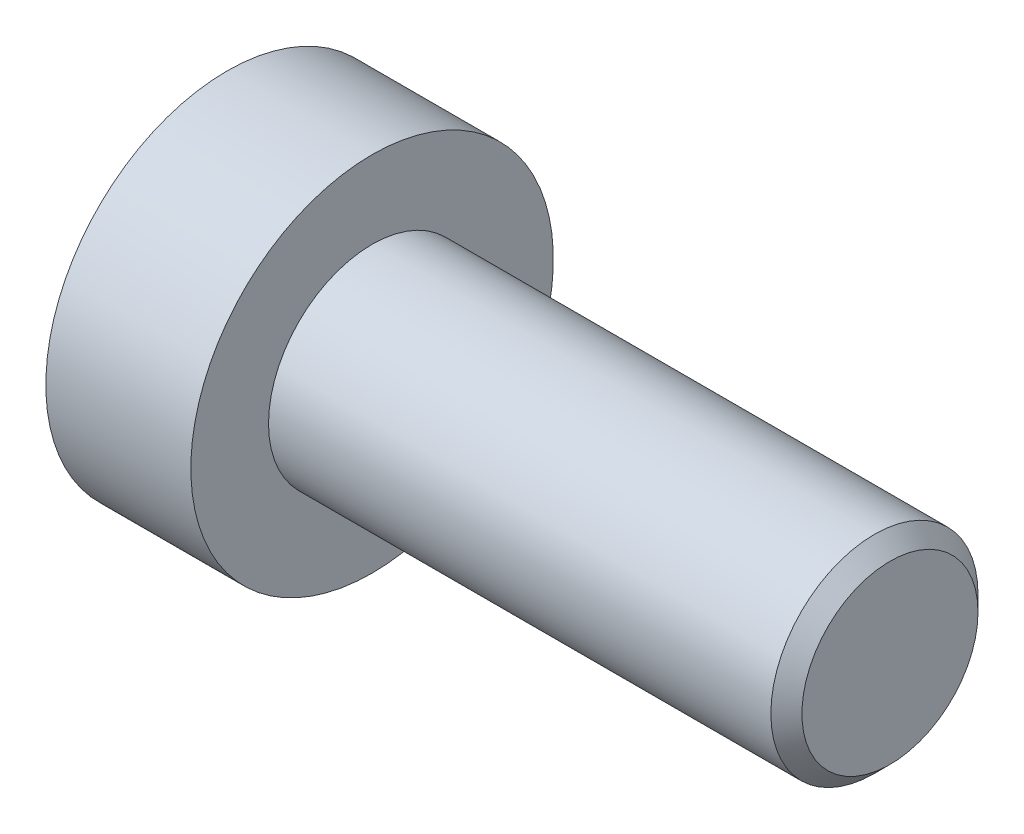
ISO-10303-21;
HEADER;
FILE_DESCRIPTION(('STEP AP214'),'2;1');
FILE_NAME('part.step','',(''),(''),'','','');
FILE_SCHEMA(('AUTOMOTIVE_DESIGN { 1 0 10303 214 1 1 1 1 }'));
ENDSEC;
DATA;
#1=APPLICATION_CONTEXT('core data for automotive mechanical design processes');
#2=APPLICATION_PROTOCOL_DEFINITION('international standard','automotive_design',2000,#1);
#3=PRODUCT_CONTEXT('',#1,'mechanical');
#4=PRODUCT('Part','Part','',(#3));
#5=PRODUCT_RELATED_PRODUCT_CATEGORY('part','',(#4));
#6=PRODUCT_DEFINITION_FORMATION('','',#4);
#7=PRODUCT_DEFINITION_CONTEXT('part definition',#1,'design');
#8=PRODUCT_DEFINITION('design','',#6,#7);
#9=PRODUCT_DEFINITION_SHAPE('','',#8);
#10=(LENGTH_UNIT() NAMED_UNIT(*) SI_UNIT(.MILLI.,.METRE.));
#11=(NAMED_UNIT(*) PLANE_ANGLE_UNIT() SI_UNIT($,.RADIAN.));
#12=(NAMED_UNIT(*) SI_UNIT($,.STERADIAN.) SOLID_ANGLE_UNIT());
#13=UNCERTAINTY_MEASURE_WITH_UNIT(LENGTH_MEASURE(1.E-05),#10,'distance_accuracy_value','');
#14=(GEOMETRIC_REPRESENTATION_CONTEXT(3) GLOBAL_UNCERTAINTY_ASSIGNED_CONTEXT((#13)) GLOBAL_UNIT_ASSIGNED_CONTEXT((#10,
#11,#12)) REPRESENTATION_CONTEXT('',''));
#15=CARTESIAN_POINT('',(0.,0.,0.));
#16=DIRECTION('',(0.,0.,1.));
#17=DIRECTION('',(1.,0.,0.));
#18=AXIS2_PLACEMENT_3D('',#15,#16,#17);
#19=CARTESIAN_POINT('',(-10.,0.,0.));
#20=DIRECTION('',(1.,0.,0.));
#21=DIRECTION('',(0.,0.,-1.));
#22=AXIS2_PLACEMENT_3D('',#19,#20,#21);
#23=CYLINDRICAL_SURFACE('',#22,2.);
#24=CARTESIAN_POINT('',(-0.3,0.,0.));
#25=DIRECTION('',(1.,0.,0.));
#26=DIRECTION('',(0.,0.,-1.));
#27=AXIS2_PLACEMENT_3D('',#24,#25,#26);
#28=CIRCLE('',#27,2.);
#29=CARTESIAN_POINT('',(-0.3,0.,-2.));
#30=VERTEX_POINT('',#29);
#31=EDGE_CURVE('E46',#30,#30,#28,.F.);
#32=ORIENTED_EDGE('',*,*,#31,.T.);
#33=EDGE_LOOP('',(#32));
#34=FACE_BOUND('',#33,.T.);
#35=CARTESIAN_POINT('',(-10.,0.,0.));
#36=DIRECTION('',(1.,0.,0.));
#37=DIRECTION('',(0.,1.,0.));
#38=AXIS2_PLACEMENT_3D('',#35,#36,#37);
#39=CIRCLE('',#38,2.);
#40=CARTESIAN_POINT('',(-10.,1.99999999999999,0.));
#41=VERTEX_POINT('',#40);
#42=EDGE_CURVE('E122',#41,#41,#39,.F.);
#43=ORIENTED_EDGE('',*,*,#42,.F.);
#44=EDGE_LOOP('',(#43));
#45=FACE_BOUND('',#44,.T.);
#46=ADVANCED_FACE('F33',(#34,#45),#23,.T.);
#47=CARTESIAN_POINT('',(0.,0.,0.));
#48=DIRECTION('',(1.,0.,0.));
#49=DIRECTION('',(0.,0.,-1.));
#50=AXIS2_PLACEMENT_3D('',#47,#48,#49);
#51=PLANE('',#50);
#52=CARTESIAN_POINT('',(0.,0.,0.));
#53=DIRECTION('',(1.,0.,0.));
#54=DIRECTION('',(0.,0.,-1.));
#55=AXIS2_PLACEMENT_3D('',#52,#53,#54);
#56=CIRCLE('',#55,1.7);
#57=CARTESIAN_POINT('',(0.,0.,-1.7));
#58=VERTEX_POINT('',#57);
#59=EDGE_CURVE('E125',#58,#58,#56,.T.);
#60=ORIENTED_EDGE('',*,*,#59,.T.);
#61=EDGE_LOOP('',(#60));
#62=FACE_BOUND('',#61,.T.);
#63=ADVANCED_FACE('F135',(#62),#51,.T.);
#64=CARTESIAN_POINT('',(0.,0.,0.));
#65=DIRECTION('',(-1.,0.,0.));
#66=DIRECTION('',(0.,0.,1.));
#67=AXIS2_PLACEMENT_3D('',#64,#65,#66);
#68=CONICAL_SURFACE('',#67,1.7,0.785398163397448);
#69=ORIENTED_EDGE('',*,*,#31,.F.);
#70=EDGE_LOOP('',(#69));
#71=FACE_BOUND('',#70,.T.);
#72=ORIENTED_EDGE('',*,*,#59,.F.);
#73=EDGE_LOOP('',(#72));
#74=FACE_BOUND('',#73,.T.);
#75=ADVANCED_FACE('F35',(#71,#74),#68,.T.);
#76=CARTESIAN_POINT('',(-12.8,0.,0.));
#77=DIRECTION('',(-1.,0.,0.));
#78=DIRECTION('',(0.,-1.,0.));
#79=AXIS2_PLACEMENT_3D('',#76,#77,#78);
#80=PLANE('',#79);
#81=CARTESIAN_POINT('',(-12.8,0.,0.));
#82=DIRECTION('',(-1.,0.,0.));
#83=DIRECTION('',(0.,-1.,0.));
#84=AXIS2_PLACEMENT_3D('',#81,#82,#83);
#85=CIRCLE('',#84,1.49337567297408);
#86=CARTESIAN_POINT('',(-12.8,-1.49337567297405,0.));
#87=VERTEX_POINT('',#86);
#88=EDGE_CURVE('E235',#87,#87,#85,.T.);
#89=ORIENTED_EDGE('',*,*,#88,.F.);
#90=EDGE_LOOP('',(#89));
#91=FACE_BOUND('',#90,.T.);
#92=CARTESIAN_POINT('',(-12.8,0.,0.));
#93=DIRECTION('',(1.,0.,0.));
#94=DIRECTION('',(0.,1.,0.));
#95=AXIS2_PLACEMENT_3D('',#92,#93,#94);
#96=CIRCLE('',#95,3.5);
#97=CARTESIAN_POINT('',(-12.8,3.5,0.));
#98=VERTEX_POINT('',#97);
#99=EDGE_CURVE('E119',#98,#98,#96,.T.);
#100=ORIENTED_EDGE('',*,*,#99,.F.);
#101=EDGE_LOOP('',(#100));
#102=FACE_BOUND('',#101,.T.);
#103=ADVANCED_FACE('F134',(#91,#102),#80,.T.);
#104=CARTESIAN_POINT('',(-10.,0.,0.));
#105=DIRECTION('',(1.,0.,0.));
#106=DIRECTION('',(0.,1.,0.));
#107=AXIS2_PLACEMENT_3D('',#104,#105,#106);
#108=CYLINDRICAL_SURFACE('',#107,3.5);
#109=ORIENTED_EDGE('',*,*,#99,.T.);
#110=EDGE_LOOP('',(#109));
#111=FACE_BOUND('',#110,.T.);
#112=CARTESIAN_POINT('',(-10.,0.,0.));
#113=DIRECTION('',(1.,0.,0.));
#114=DIRECTION('',(0.,1.,0.));
#115=AXIS2_PLACEMENT_3D('',#112,#113,#114);
#116=CIRCLE('',#115,3.5);
#117=CARTESIAN_POINT('',(-10.,3.5,0.));
#118=VERTEX_POINT('',#117);
#119=EDGE_CURVE('E116',#118,#118,#116,.T.);
#120=ORIENTED_EDGE('',*,*,#119,.F.);
#121=EDGE_LOOP('',(#120));
#122=FACE_BOUND('',#121,.T.);
#123=ADVANCED_FACE('F146',(#111,#122),#108,.T.);
#124=CARTESIAN_POINT('',(-10.,3.5,0.));
#125=DIRECTION('',(1.,0.,0.));
#126=DIRECTION('',(0.,1.,0.));
#127=AXIS2_PLACEMENT_3D('',#124,#125,#126);
#128=PLANE('',#127);
#129=ORIENTED_EDGE('',*,*,#42,.T.);
#130=EDGE_LOOP('',(#129));
#131=FACE_BOUND('',#130,.T.);
#132=ORIENTED_EDGE('',*,*,#119,.T.);
#133=EDGE_LOOP('',(#132));
#134=FACE_BOUND('',#133,.T.);
#135=ADVANCED_FACE('F150',(#131,#134),#128,.T.);
#136=CARTESIAN_POINT('',(-12.8,0.,0.));
#137=DIRECTION('',(-1.,0.,0.));
#138=DIRECTION('',(0.,-1.,0.));
#139=AXIS2_PLACEMENT_3D('',#136,#137,#138);
#140=CONICAL_SURFACE('',#139,1.49337567297408,0.78539816339745);
#141=ORIENTED_EDGE('',*,*,#88,.T.);
#142=EDGE_LOOP('',(#141));
#143=FACE_BOUND('',#142,.T.);
#144=CARTESIAN_POINT('',(-13.2014021689884,-1.42396736984799,1.25));
#145=CARTESIAN_POINT('',(-13.175296136448,-1.38922450814775,1.25));
#146=CARTESIAN_POINT('',(-13.1494506563431,-1.35428640192997,1.25));
#147=CARTESIAN_POINT('',(-13.0983879120234,-1.28394100441963,1.25));
#148=CARTESIAN_POINT('',(-13.0731708093588,-1.24853359598577,1.25));
#149=CARTESIAN_POINT('',(-12.9982633539511,-1.1409714001612,1.25));
#150=CARTESIAN_POINT('',(-12.9497190435972,-1.06800495826751,1.25));
#151=CARTESIAN_POINT('',(-12.8545600162985,-0.915095472420354,1.25));
#152=CARTESIAN_POINT('',(-12.8082030382604,-0.834990154954497,1.25));
#153=CARTESIAN_POINT('',(-12.7235039270025,-0.670798348959414,1.25));
#154=CARTESIAN_POINT('',(-12.6851347978723,-0.586726487937162,1.25));
#155=CARTESIAN_POINT('',(-12.6381985020476,-0.4603853347687,1.25));
#156=CARTESIAN_POINT('',(-12.6247021207698,-0.419954113336606,1.25));
#157=CARTESIAN_POINT('',(-12.6009573074475,-0.338129031291284,1.25));
#158=CARTESIAN_POINT('',(-12.5907091035293,-0.296735103284177,1.25));
#159=CARTESIAN_POINT('',(-12.5741594663552,-0.213916243687791,1.25));
#160=CARTESIAN_POINT('',(-12.5677913385525,-0.172504848949339,1.25));
#161=CARTESIAN_POINT('',(-12.5591237196608,-0.0892560954741958,1.25));
#162=CARTESIAN_POINT('',(-12.5568235599982,-0.0474188078703036,1.25));
#163=CARTESIAN_POINT('',(-12.5564564105193,0.0348235296905035,1.25));
#164=CARTESIAN_POINT('',(-12.5582455485416,0.0752279922916804,1.25));
#165=CARTESIAN_POINT('',(-12.5656448035135,0.155687005579609,1.25));
#166=CARTESIAN_POINT('',(-12.5712556629701,0.195741486737963,1.25));
#167=CARTESIAN_POINT('',(-12.5860898151071,0.275882483894671,1.25));
#168=CARTESIAN_POINT('',(-12.5953738895404,0.315957579678775,1.25));
#169=CARTESIAN_POINT('',(-12.6170656964992,0.395234027395283,1.25));
#170=CARTESIAN_POINT('',(-12.6294731489784,0.434435457318923,1.25));
#171=CARTESIAN_POINT('',(-12.6734108304631,0.558570325397122,1.25));
#172=CARTESIAN_POINT('',(-12.7099744143289,0.641718054005943,1.25));
#173=CARTESIAN_POINT('',(-12.7912478873066,0.804100725662085,1.25));
#174=CARTESIAN_POINT('',(-12.8359871895297,0.883320183915875,1.25));
#175=CARTESIAN_POINT('',(-12.9282652286461,1.03470895505822,1.25));
#176=CARTESIAN_POINT('',(-12.9755534388818,1.10703287925038,1.25));
#177=CARTESIAN_POINT('',(-13.0486463209253,1.21358798649191,1.25));
#178=CARTESIAN_POINT('',(-13.0732664432996,1.24864609054882,1.25));
#179=CARTESIAN_POINT('',(-13.123155260131,1.31828380805649,1.25));
#180=CARTESIAN_POINT('',(-13.1484237758017,1.35286354944694,1.25));
#181=CARTESIAN_POINT('',(-13.1739610581168,1.38724419886388,1.25));
#182=B_SPLINE_CURVE_WITH_KNOTS('',3,(#144,#145,#146,#147,#148,#149,#150,#151,#152,#153,#154,
#155,#156,#157,#158,#159,#160,#161,#162,#163,#164,#165,#166,#167,#168,#169,#170,#171,#172,#173,
#174,#175,#176,#177,#178,#179,#180,#181),.UNSPECIFIED.,.F.,.F.,(4,2,2,2,2,2,2,2,2,2,2,2,2,2,2,2,
2,2,4),(0.,0.130370422461748,0.260774023229279,0.523571931962181,0.800995227642794,
1.07746514553942,1.20522972687283,1.33300327939672,1.45851355132216,1.5840031936199,
1.70514602294322,1.82631239533597,1.94957373840992,2.07282403363807,2.34451838945522,
2.61721016161585,2.87631588769062,3.00482945023601,3.13330794967362),.UNSPECIFIED.);
#183=CARTESIAN_POINT('',(-12.75,-0.721687836487001,1.25));
#184=VERTEX_POINT('',#183);
#185=CARTESIAN_POINT('',(-12.75,0.721687836487064,1.25));
#186=VERTEX_POINT('',#185);
#187=EDGE_CURVE('E100',#184,#186,#182,.T.);
#188=ORIENTED_EDGE('',*,*,#187,.F.);
#189=CARTESIAN_POINT('',(-12.7501154839091,-1.44349114302787,-0.000200000000000717));
#190=CARTESIAN_POINT('',(-12.7253216680551,-1.41867941875062,0.0427751670715863));
#191=CARTESIAN_POINT('',(-12.7019837344187,-1.3934527698074,0.0864690047459477));
#192=CARTESIAN_POINT('',(-12.6592520040845,-1.34201263554191,0.175565930841941));
#193=CARTESIAN_POINT('',(-12.6398819923604,-1.31579425481273,0.220977498357063));
#194=CARTESIAN_POINT('',(-12.6067004834135,-1.26292610442243,0.312547820935259));
#195=CARTESIAN_POINT('',(-12.5928055590526,-1.23628980770468,0.358683240175884));
#196=CARTESIAN_POINT('',(-12.5713972821606,-1.18243062538505,0.451970080407591));
#197=CARTESIAN_POINT('',(-12.5638679415668,-1.15520938653758,0.499118649136379));
#198=CARTESIAN_POINT('',(-12.5570744980507,-1.10829684367464,0.580373556887251));
#199=CARTESIAN_POINT('',(-12.5560685591043,-1.08866617256955,0.61437487662794));
#200=CARTESIAN_POINT('',(-12.5577614149113,-1.04943932800608,0.682317764432476));
#201=CARTESIAN_POINT('',(-12.5604610272155,-1.02984316311596,0.716259317655657));
#202=CARTESIAN_POINT('',(-12.5694089303164,-0.990839954603469,0.783814856457499));
#203=CARTESIAN_POINT('',(-12.5756605258997,-0.971433104248741,0.817428507286774));
#204=CARTESIAN_POINT('',(-12.5913756814139,-0.932943395609875,0.884094638217812));
#205=CARTESIAN_POINT('',(-12.6008406200874,-0.91386068009827,0.917146871030295));
#206=CARTESIAN_POINT('',(-12.6289313906876,-0.864986351354537,1.00179969160026));
#207=CARTESIAN_POINT('',(-12.6496701574522,-0.835502920149045,1.05286649242964));
#208=CARTESIAN_POINT('',(-12.6963871346715,-0.777690319475878,1.15300085411325));
#209=CARTESIAN_POINT('',(-12.7223482959468,-0.749357745598386,1.20207431157827));
#210=CARTESIAN_POINT('',(-12.7501154839091,-0.721572366433164,1.2502));
#211=B_SPLINE_CURVE_WITH_KNOTS('',3,(#189,#190,#191,#192,#193,#194,#195,#196,#197,#198,#199,
#200,#201,#202,#203,#204,#205,#206,#207,#208,#209,#210),.UNSPECIFIED.,.F.,.F.,(4,2,2,2,2,2,2,2,
2,2,4),(0.,0.166533409618304,0.334037607289762,0.498880396489697,0.663307919240274,
0.780963963458827,0.898645970148453,1.01643764860773,1.13427993171549,1.32148652032141,
1.50809158792573),.UNSPECIFIED.);
#212=CARTESIAN_POINT('',(-12.75,-1.44337567297403,0.));
#213=VERTEX_POINT('',#212);
#214=EDGE_CURVE('E192',#213,#184,#211,.T.);
#215=ORIENTED_EDGE('',*,*,#214,.F.);
#216=CARTESIAN_POINT('',(-12.7501154839091,-0.721572366433163,-1.2502));
#217=CARTESIAN_POINT('',(-12.7253216680551,-0.746384090710413,-1.20722483292841));
#218=CARTESIAN_POINT('',(-12.7019837344187,-0.771610739653633,-1.16353099525405));
#219=CARTESIAN_POINT('',(-12.6592520040845,-0.823050873919123,-1.07443406915806));
#220=CARTESIAN_POINT('',(-12.6398819923604,-0.849269254648302,-1.02902250164294));
#221=CARTESIAN_POINT('',(-12.6067004834135,-0.902137405038604,-0.937452179064741));
#222=CARTESIAN_POINT('',(-12.5928055590526,-0.928773701756356,-0.891316759824115));
#223=CARTESIAN_POINT('',(-12.5713972821606,-0.982632884075981,-0.798029919592408));
#224=CARTESIAN_POINT('',(-12.5638679415668,-1.00985412292345,-0.750881350863621));
#225=CARTESIAN_POINT('',(-12.5570744980507,-1.0567666657864,-0.669626443112748));
#226=CARTESIAN_POINT('',(-12.5560685591043,-1.07639733689149,-0.63562512337206));
#227=CARTESIAN_POINT('',(-12.5577614149113,-1.11562418145496,-0.567682235567524));
#228=CARTESIAN_POINT('',(-12.5604610272155,-1.13522034634507,-0.533740682344343));
#229=CARTESIAN_POINT('',(-12.5694089303164,-1.17422355485757,-0.466185143542501));
#230=CARTESIAN_POINT('',(-12.5756605258997,-1.19363040521229,-0.432571492713226));
#231=CARTESIAN_POINT('',(-12.5913756814139,-1.23212011385116,-0.365905361782188));
#232=CARTESIAN_POINT('',(-12.6008406200874,-1.25120282936276,-0.332853128969706));
#233=CARTESIAN_POINT('',(-12.6289313906876,-1.3000771581065,-0.248200308399737));
#234=CARTESIAN_POINT('',(-12.6496701574522,-1.32956058931199,-0.197133507570363));
#235=CARTESIAN_POINT('',(-12.6963871346715,-1.38737318998516,-0.0969991458867457));
#236=CARTESIAN_POINT('',(-12.7223482959468,-1.41570576386265,-0.0479256884217312));
#237=CARTESIAN_POINT('',(-12.7501154839091,-1.44349114302787,0.000199999999999392));
#238=B_SPLINE_CURVE_WITH_KNOTS('',3,(#216,#217,#218,#219,#220,#221,#222,#223,#224,#225,#226,
#227,#228,#229,#230,#231,#232,#233,#234,#235,#236,#237),.UNSPECIFIED.,.F.,.F.,(4,2,2,2,2,2,2,2,
2,2,4),(0.,0.166533409618303,0.33403760728976,0.498880396489697,0.663307919240273,
0.780963963458825,0.898645970148451,1.01643764860773,1.13427993171549,1.32148652032141,
1.50809158792573),.UNSPECIFIED.);
#239=CARTESIAN_POINT('',(-12.75,-0.721687836487001,-1.25));
#240=VERTEX_POINT('',#239);
#241=EDGE_CURVE('E187',#240,#213,#238,.T.);
#242=ORIENTED_EDGE('',*,*,#241,.F.);
#243=CARTESIAN_POINT('',(-13.2014021689884,-1.42396736984798,-1.25));
#244=CARTESIAN_POINT('',(-13.175296136448,-1.38922450814775,-1.25));
#245=CARTESIAN_POINT('',(-13.1494506563431,-1.35428640192997,-1.25));
#246=CARTESIAN_POINT('',(-13.0983879120234,-1.28394100441963,-1.25));
#247=CARTESIAN_POINT('',(-13.0731708093588,-1.24853359598577,-1.25));
#248=CARTESIAN_POINT('',(-12.9982633539511,-1.1409714001612,-1.25));
#249=CARTESIAN_POINT('',(-12.9497190435972,-1.06800495826751,-1.25));
#250=CARTESIAN_POINT('',(-12.8545600162985,-0.915095472420353,-1.25));
#251=CARTESIAN_POINT('',(-12.8082030382604,-0.834990154954496,-1.25));
#252=CARTESIAN_POINT('',(-12.7235039270025,-0.670798348959412,-1.25));
#253=CARTESIAN_POINT('',(-12.6851347978723,-0.586726487937161,-1.25));
#254=CARTESIAN_POINT('',(-12.6381985020476,-0.460385334768699,-1.25));
#255=CARTESIAN_POINT('',(-12.6247021207698,-0.419954113336604,-1.25));
#256=CARTESIAN_POINT('',(-12.6009573074475,-0.338129031291283,-1.25));
#257=CARTESIAN_POINT('',(-12.5907091035293,-0.296735103284176,-1.25));
#258=CARTESIAN_POINT('',(-12.5741594663552,-0.21391624368779,-1.25));
#259=CARTESIAN_POINT('',(-12.5677913385525,-0.172504848949338,-1.25));
#260=CARTESIAN_POINT('',(-12.5591237196608,-0.0892560954741953,-1.25));
#261=CARTESIAN_POINT('',(-12.5568235599982,-0.0474188078703032,-1.25));
#262=CARTESIAN_POINT('',(-12.5564564105193,0.0348235296905037,-1.25));
#263=CARTESIAN_POINT('',(-12.5582455485416,0.0752279922916807,-1.25));
#264=CARTESIAN_POINT('',(-12.5656448035135,0.155687005579609,-1.25));
#265=CARTESIAN_POINT('',(-12.5712556629701,0.195741486737964,-1.25));
#266=CARTESIAN_POINT('',(-12.5860898151071,0.275882483894671,-1.25));
#267=CARTESIAN_POINT('',(-12.5953738895404,0.315957579678775,-1.25));
#268=CARTESIAN_POINT('',(-12.6170656964992,0.395234027395283,-1.25));
#269=CARTESIAN_POINT('',(-12.6294731489784,0.434435457318923,-1.25));
#270=CARTESIAN_POINT('',(-12.6734108304631,0.558570325397123,-1.25));
#271=CARTESIAN_POINT('',(-12.7099744143289,0.641718054005944,-1.25));
#272=CARTESIAN_POINT('',(-12.7912478873066,0.804100725662085,-1.25));
#273=CARTESIAN_POINT('',(-12.8359871895297,0.883320183915875,-1.25));
#274=CARTESIAN_POINT('',(-12.9282652286461,1.03470895505822,-1.25));
#275=CARTESIAN_POINT('',(-12.9755534388818,1.10703287925038,-1.25));
#276=CARTESIAN_POINT('',(-13.0486463209253,1.21358798649191,-1.25));
#277=CARTESIAN_POINT('',(-13.0732664432996,1.24864609054882,-1.25));
#278=CARTESIAN_POINT('',(-13.123155260131,1.31828380805649,-1.25));
#279=CARTESIAN_POINT('',(-13.1484237758017,1.35286354944694,-1.25));
#280=CARTESIAN_POINT('',(-13.1739610581168,1.38724419886388,-1.25));
#281=B_SPLINE_CURVE_WITH_KNOTS('',3,(#243,#244,#245,#246,#247,#248,#249,#250,#251,#252,#253,
#254,#255,#256,#257,#258,#259,#260,#261,#262,#263,#264,#265,#266,#267,#268,#269,#270,#271,#272,
#273,#274,#275,#276,#277,#278,#279,#280),.UNSPECIFIED.,.F.,.F.,(4,2,2,2,2,2,2,2,2,2,2,2,2,2,2,2,
2,2,4),(0.,0.130370422461749,0.26077402322928,0.523571931962181,0.800995227642793,
1.07746514553942,1.20522972687283,1.33300327939672,1.45851355132216,1.5840031936199,
1.70514602294322,1.82631239533597,1.94957373840992,2.07282403363807,2.34451838945522,
2.61721016161585,2.87631588769062,3.00482945023601,3.13330794967362),.UNSPECIFIED.);
#282=CARTESIAN_POINT('',(-12.75,0.721687836487063,-1.25));
#283=VERTEX_POINT('',#282);
#284=EDGE_CURVE('E53',#283,#240,#281,.F.);
#285=ORIENTED_EDGE('',*,*,#284,.F.);
#286=CARTESIAN_POINT('',(-12.7501154839091,1.44349114302793,0.000200000000000434));
#287=CARTESIAN_POINT('',(-12.7253216680551,1.41867941875068,-0.0427751670715862));
#288=CARTESIAN_POINT('',(-12.7019837344187,1.39345276980746,-0.0864690047459475));
#289=CARTESIAN_POINT('',(-12.6592520040845,1.34201263554197,-0.175565930841942));
#290=CARTESIAN_POINT('',(-12.6398819923604,1.31579425481279,-0.220977498357064));
#291=CARTESIAN_POINT('',(-12.6067004834135,1.26292610442249,-0.31254782093526));
#292=CARTESIAN_POINT('',(-12.5928055590526,1.23628980770474,-0.358683240175885));
#293=CARTESIAN_POINT('',(-12.5713972821606,1.18243062538511,-0.451970080407592));
#294=CARTESIAN_POINT('',(-12.5638679415668,1.15520938653764,-0.499118649136379));
#295=CARTESIAN_POINT('',(-12.5570744980507,1.1082968436747,-0.580373556887252));
#296=CARTESIAN_POINT('',(-12.5560685591043,1.08866617256961,-0.614374876627941));
#297=CARTESIAN_POINT('',(-12.5577614149113,1.04943932800614,-0.682317764432477));
#298=CARTESIAN_POINT('',(-12.5604610272155,1.02984316311602,-0.716259317655657));
#299=CARTESIAN_POINT('',(-12.5694089303164,0.99083995460353,-0.783814856457499));
#300=CARTESIAN_POINT('',(-12.5756605258997,0.971433104248801,-0.817428507286774));
#301=CARTESIAN_POINT('',(-12.5913756814139,0.932943395609936,-0.884094638217813));
#302=CARTESIAN_POINT('',(-12.6008406200874,0.913860680098331,-0.917146871030295));
#303=CARTESIAN_POINT('',(-12.6289313906876,0.864986351354599,-1.00179969160026));
#304=CARTESIAN_POINT('',(-12.6496701574522,0.835502920149107,-1.05286649242964));
#305=CARTESIAN_POINT('',(-12.6963871346715,0.777690319475939,-1.15300085411325));
#306=CARTESIAN_POINT('',(-12.7223482959467,0.749357745598448,-1.20207431157827));
#307=CARTESIAN_POINT('',(-12.7501154839091,0.721572366433226,-1.2502));
#308=B_SPLINE_CURVE_WITH_KNOTS('',3,(#286,#287,#288,#289,#290,#291,#292,#293,#294,#295,#296,
#297,#298,#299,#300,#301,#302,#303,#304,#305,#306,#307),.UNSPECIFIED.,.F.,.F.,(4,2,2,2,2,2,2,2,
2,2,4),(0.,0.166533409618304,0.334037607289762,0.498880396489698,0.663307919240275,
0.780963963458827,0.898645970148453,1.01643764860773,1.1342799317155,1.32148652032141,
1.50809158792574),.UNSPECIFIED.);
#309=CARTESIAN_POINT('',(-12.75,1.4433756729741,0.));
#310=VERTEX_POINT('',#309);
#311=EDGE_CURVE('E11',#310,#283,#308,.T.);
#312=ORIENTED_EDGE('',*,*,#311,.F.);
#313=CARTESIAN_POINT('',(-12.7501154839091,0.721572366433226,1.2502));
#314=CARTESIAN_POINT('',(-12.7253216680551,0.746384090710475,1.20722483292841));
#315=CARTESIAN_POINT('',(-12.7019837344187,0.771610739653695,1.16353099525405));
#316=CARTESIAN_POINT('',(-12.6592520040845,0.823050873919186,1.07443406915806));
#317=CARTESIAN_POINT('',(-12.6398819923604,0.849269254648364,1.02902250164294));
#318=CARTESIAN_POINT('',(-12.6067004834135,0.902137405038666,0.93745217906474));
#319=CARTESIAN_POINT('',(-12.5928055590526,0.928773701756417,0.891316759824115));
#320=CARTESIAN_POINT('',(-12.5713972821606,0.982632884076043,0.798029919592408));
#321=CARTESIAN_POINT('',(-12.5638679415668,1.00985412292351,0.750881350863621));
#322=CARTESIAN_POINT('',(-12.5570744980507,1.05676666578646,0.669626443112749));
#323=CARTESIAN_POINT('',(-12.5560685591043,1.07639733689155,0.63562512337206));
#324=CARTESIAN_POINT('',(-12.5577614149113,1.11562418145502,0.567682235567524));
#325=CARTESIAN_POINT('',(-12.5604610272155,1.13522034634513,0.533740682344344));
#326=CARTESIAN_POINT('',(-12.5694089303164,1.17422355485763,0.466185143542502));
#327=CARTESIAN_POINT('',(-12.5756605258997,1.19363040521236,0.432571492713226));
#328=CARTESIAN_POINT('',(-12.5913756814139,1.23212011385122,0.365905361782188));
#329=CARTESIAN_POINT('',(-12.6008406200874,1.25120282936283,0.332853128969706));
#330=CARTESIAN_POINT('',(-12.6289313906876,1.30007715810656,0.248200308399737));
#331=CARTESIAN_POINT('',(-12.6496701574522,1.32956058931205,0.197133507570362));
#332=CARTESIAN_POINT('',(-12.6963871346715,1.38737318998522,0.0969991458867453));
#333=CARTESIAN_POINT('',(-12.7223482959467,1.41570576386271,0.0479256884217305));
#334=CARTESIAN_POINT('',(-12.7501154839091,1.44349114302793,-0.000199999999999747));
#335=B_SPLINE_CURVE_WITH_KNOTS('',3,(#313,#314,#315,#316,#317,#318,#319,#320,#321,#322,#323,
#324,#325,#326,#327,#328,#329,#330,#331,#332,#333,#334),.UNSPECIFIED.,.F.,.F.,(4,2,2,2,2,2,2,2,
2,2,4),(0.,0.166533409618303,0.334037607289761,0.498880396489697,0.663307919240272,
0.780963963458825,0.898645970148451,1.01643764860773,1.13427993171549,1.32148652032141,
1.50809158792573),.UNSPECIFIED.);
#336=EDGE_CURVE('E91',#186,#310,#335,.T.);
#337=ORIENTED_EDGE('',*,*,#336,.F.);
#338=EDGE_LOOP('',(#188,#215,#242,#285,#312,#337));
#339=FACE_BOUND('',#338,.T.);
#340=ADVANCED_FACE('F90',(#143,#339),#140,.F.);
#341=CARTESIAN_POINT('',(-11.2,0.,0.));
#342=DIRECTION('',(-1.,0.,0.));
#343=DIRECTION('',(0.,-1.,0.));
#344=AXIS2_PLACEMENT_3D('',#341,#342,#343);
#345=PLANE('',#344);
#346=DIRECTION('',(0.,0.5,-0.866025403784439));
#347=VECTOR('',#346,1.);
#348=CARTESIAN_POINT('',(-11.2,0.721687836487058,1.25));
#349=LINE('',#348,#347);
#350=CARTESIAN_POINT('',(-11.2,0.721687836487058,1.25));
#351=VERTEX_POINT('',#350);
#352=CARTESIAN_POINT('',(-11.2,1.44337567297409,0.));
#353=VERTEX_POINT('',#352);
#354=EDGE_CURVE('E99',#351,#353,#349,.T.);
#355=ORIENTED_EDGE('',*,*,#354,.T.);
#356=DIRECTION('',(0.,-0.5,-0.866025403784439));
#357=VECTOR('',#356,1.);
#358=CARTESIAN_POINT('',(-11.2,1.44337567297409,0.));
#359=LINE('',#358,#357);
#360=CARTESIAN_POINT('',(-11.2,0.721687836487058,-1.25));
#361=VERTEX_POINT('',#360);
#362=EDGE_CURVE('E104',#353,#361,#359,.T.);
#363=ORIENTED_EDGE('',*,*,#362,.T.);
#364=DIRECTION('',(0.,-1.,0.));
#365=VECTOR('',#364,1.);
#366=CARTESIAN_POINT('',(-11.2,0.721687836487058,-1.25));
#367=LINE('',#366,#365);
#368=CARTESIAN_POINT('',(-11.2,-0.721687836487007,-1.25));
#369=VERTEX_POINT('',#368);
#370=EDGE_CURVE('E217',#361,#369,#367,.T.);
#371=ORIENTED_EDGE('',*,*,#370,.T.);
#372=DIRECTION('',(0.,-0.5,0.866025403784439));
#373=VECTOR('',#372,1.);
#374=CARTESIAN_POINT('',(-11.2,-0.721687836487007,-1.25));
#375=LINE('',#374,#373);
#376=CARTESIAN_POINT('',(-11.2,-1.44337567297404,0.));
#377=VERTEX_POINT('',#376);
#378=EDGE_CURVE('E221',#369,#377,#375,.T.);
#379=ORIENTED_EDGE('',*,*,#378,.T.);
#380=DIRECTION('',(0.,0.5,0.866025403784439));
#381=VECTOR('',#380,1.);
#382=CARTESIAN_POINT('',(-11.2,-1.44337567297404,0.));
#383=LINE('',#382,#381);
#384=CARTESIAN_POINT('',(-11.2,-0.721687836487007,1.25));
#385=VERTEX_POINT('',#384);
#386=EDGE_CURVE('E112',#377,#385,#383,.T.);
#387=ORIENTED_EDGE('',*,*,#386,.T.);
#388=DIRECTION('',(0.,1.,0.));
#389=VECTOR('',#388,1.);
#390=CARTESIAN_POINT('',(-11.2,-0.721687836487007,1.25));
#391=LINE('',#390,#389);
#392=EDGE_CURVE('E107',#385,#351,#391,.T.);
#393=ORIENTED_EDGE('',*,*,#392,.T.);
#394=EDGE_LOOP('',(#355,#363,#371,#379,#387,#393));
#395=FACE_BOUND('',#394,.T.);
#396=ADVANCED_FACE('F174',(#395),#345,.T.);
#397=CARTESIAN_POINT('',(-11.2,1.44337567297409,0.));
#398=DIRECTION('',(0.,0.866025403784439,-0.5));
#399=DIRECTION('',(0.,0.5,0.866025403784439));
#400=AXIS2_PLACEMENT_3D('',#397,#398,#399);
#401=PLANE('',#400);
#402=DIRECTION('',(-1.,0.,0.));
#403=VECTOR('',#402,1.);
#404=CARTESIAN_POINT('',(-11.2,1.44337567297409,0.));
#405=LINE('',#404,#403);
#406=EDGE_CURVE('E97',#353,#310,#405,.T.);
#407=ORIENTED_EDGE('',*,*,#406,.T.);
#408=ORIENTED_EDGE('',*,*,#311,.T.);
#409=DIRECTION('',(-1.,0.,0.));
#410=VECTOR('',#409,1.);
#411=CARTESIAN_POINT('',(-11.2,0.721687836487058,-1.25));
#412=LINE('',#411,#410);
#413=EDGE_CURVE('E106',#361,#283,#412,.T.);
#414=ORIENTED_EDGE('',*,*,#413,.F.);
#415=ORIENTED_EDGE('',*,*,#362,.F.);
#416=EDGE_LOOP('',(#407,#408,#414,#415));
#417=FACE_BOUND('',#416,.T.);
#418=ADVANCED_FACE('F102',(#417),#401,.F.);
#419=CARTESIAN_POINT('',(-11.2,0.721687836487058,-1.25));
#420=DIRECTION('',(0.,0.,-1.));
#421=DIRECTION('',(-1.,0.,0.));
#422=AXIS2_PLACEMENT_3D('',#419,#420,#421);
#423=PLANE('',#422);
#424=ORIENTED_EDGE('',*,*,#413,.T.);
#425=ORIENTED_EDGE('',*,*,#284,.T.);
#426=DIRECTION('',(-1.,0.,0.));
#427=VECTOR('',#426,1.);
#428=CARTESIAN_POINT('',(-11.2,-0.721687836487007,-1.25));
#429=LINE('',#428,#427);
#430=EDGE_CURVE('E109',#369,#240,#429,.T.);
#431=ORIENTED_EDGE('',*,*,#430,.F.);
#432=ORIENTED_EDGE('',*,*,#370,.F.);
#433=EDGE_LOOP('',(#424,#425,#431,#432));
#434=FACE_BOUND('',#433,.T.);
#435=ADVANCED_FACE('F206',(#434),#423,.F.);
#436=CARTESIAN_POINT('',(-11.2,-0.721687836487007,-1.25));
#437=DIRECTION('',(0.,-0.866025403784439,-0.5));
#438=DIRECTION('',(0.,0.5,-0.866025403784439));
#439=AXIS2_PLACEMENT_3D('',#436,#437,#438);
#440=PLANE('',#439);
#441=ORIENTED_EDGE('',*,*,#430,.T.);
#442=ORIENTED_EDGE('',*,*,#241,.T.);
#443=DIRECTION('',(-1.,0.,0.));
#444=VECTOR('',#443,1.);
#445=CARTESIAN_POINT('',(-11.2,-1.44337567297404,0.));
#446=LINE('',#445,#444);
#447=EDGE_CURVE('E231',#377,#213,#446,.T.);
#448=ORIENTED_EDGE('',*,*,#447,.F.);
#449=ORIENTED_EDGE('',*,*,#378,.F.);
#450=EDGE_LOOP('',(#441,#442,#448,#449));
#451=FACE_BOUND('',#450,.T.);
#452=ADVANCED_FACE('F201',(#451),#440,.F.);
#453=CARTESIAN_POINT('',(-11.2,-1.44337567297404,0.));
#454=DIRECTION('',(0.,-0.866025403784439,0.5));
#455=DIRECTION('',(0.,-0.5,-0.866025403784439));
#456=AXIS2_PLACEMENT_3D('',#453,#454,#455);
#457=PLANE('',#456);
#458=ORIENTED_EDGE('',*,*,#447,.T.);
#459=ORIENTED_EDGE('',*,*,#214,.T.);
#460=DIRECTION('',(-1.,0.,0.));
#461=VECTOR('',#460,1.);
#462=CARTESIAN_POINT('',(-11.2,-0.721687836487007,1.25));
#463=LINE('',#462,#461);
#464=EDGE_CURVE('E228',#385,#184,#463,.T.);
#465=ORIENTED_EDGE('',*,*,#464,.F.);
#466=ORIENTED_EDGE('',*,*,#386,.F.);
#467=EDGE_LOOP('',(#458,#459,#465,#466));
#468=FACE_BOUND('',#467,.T.);
#469=ADVANCED_FACE('F198',(#468),#457,.F.);
#470=CARTESIAN_POINT('',(-11.2,-0.721687836487007,1.25));
#471=DIRECTION('',(0.,0.,1.));
#472=DIRECTION('',(1.,0.,0.));
#473=AXIS2_PLACEMENT_3D('',#470,#471,#472);
#474=PLANE('',#473);
#475=ORIENTED_EDGE('',*,*,#464,.T.);
#476=ORIENTED_EDGE('',*,*,#187,.T.);
#477=DIRECTION('',(-1.,0.,0.));
#478=VECTOR('',#477,1.);
#479=CARTESIAN_POINT('',(-11.2,0.721687836487058,1.25));
#480=LINE('',#479,#478);
#481=EDGE_CURVE('E60',#351,#186,#480,.T.);
#482=ORIENTED_EDGE('',*,*,#481,.F.);
#483=ORIENTED_EDGE('',*,*,#392,.F.);
#484=EDGE_LOOP('',(#475,#476,#482,#483));
#485=FACE_BOUND('',#484,.T.);
#486=ADVANCED_FACE('F157',(#485),#474,.F.);
#487=CARTESIAN_POINT('',(-11.2,0.721687836487058,1.25));
#488=DIRECTION('',(0.,0.866025403784439,0.5));
#489=DIRECTION('',(0.,-0.5,0.866025403784439));
#490=AXIS2_PLACEMENT_3D('',#487,#488,#489);
#491=PLANE('',#490);
#492=ORIENTED_EDGE('',*,*,#481,.T.);
#493=ORIENTED_EDGE('',*,*,#336,.T.);
#494=ORIENTED_EDGE('',*,*,#406,.F.);
#495=ORIENTED_EDGE('',*,*,#354,.F.);
#496=EDGE_LOOP('',(#492,#493,#494,#495));
#497=FACE_BOUND('',#496,.T.);
#498=ADVANCED_FACE('F96',(#497),#491,.F.);
#499=CLOSED_SHELL('',(#46,#63,#75,#103,#123,#135,#340,#396,#418,#435,#452,#469,#486,#498));
#500=MANIFOLD_SOLID_BREP('B2',#499);
#501=ADVANCED_BREP_SHAPE_REPRESENTATION('',(#18,#500),#14);
#502=SHAPE_DEFINITION_REPRESENTATION(#9,#501);
ENDSEC;
END-ISO-10303-21;
